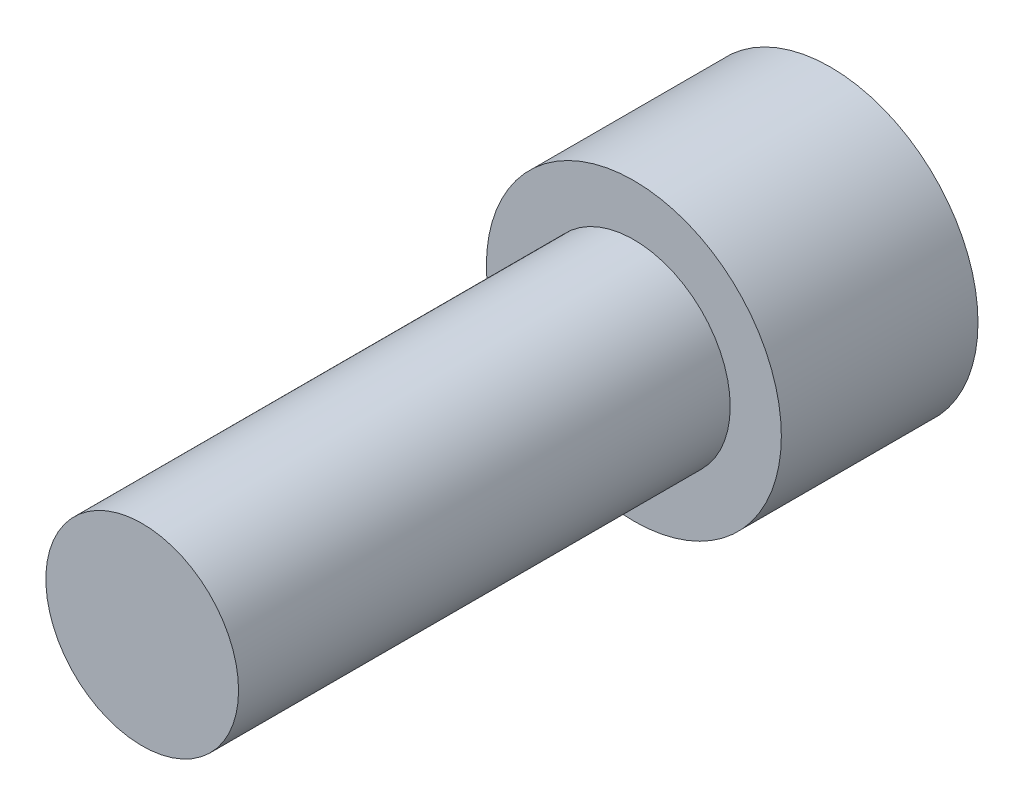
ISO-10303-21;
HEADER;
FILE_DESCRIPTION(('STEP AP214'),'2;1');
FILE_NAME('part.step','',(''),(''),'','','');
FILE_SCHEMA(('AUTOMOTIVE_DESIGN { 1 0 10303 214 1 1 1 1 }'));
ENDSEC;
DATA;
#1=APPLICATION_CONTEXT('core data for automotive mechanical design processes');
#2=APPLICATION_PROTOCOL_DEFINITION('international standard','automotive_design',2000,#1);
#3=PRODUCT_CONTEXT('',#1,'mechanical');
#4=PRODUCT('Part','Part','',(#3));
#5=PRODUCT_RELATED_PRODUCT_CATEGORY('part','',(#4));
#6=PRODUCT_DEFINITION_FORMATION('','',#4);
#7=PRODUCT_DEFINITION_CONTEXT('part definition',#1,'design');
#8=PRODUCT_DEFINITION('design','',#6,#7);
#9=PRODUCT_DEFINITION_SHAPE('','',#8);
#10=(LENGTH_UNIT() NAMED_UNIT(*) SI_UNIT(.MILLI.,.METRE.));
#11=(NAMED_UNIT(*) PLANE_ANGLE_UNIT() SI_UNIT($,.RADIAN.));
#12=(NAMED_UNIT(*) SI_UNIT($,.STERADIAN.) SOLID_ANGLE_UNIT());
#13=UNCERTAINTY_MEASURE_WITH_UNIT(LENGTH_MEASURE(1.E-05),#10,'distance_accuracy_value','');
#14=(GEOMETRIC_REPRESENTATION_CONTEXT(3) GLOBAL_UNCERTAINTY_ASSIGNED_CONTEXT((#13)) GLOBAL_UNIT_ASSIGNED_CONTEXT((#10,
#11,#12)) REPRESENTATION_CONTEXT('',''));
#15=CARTESIAN_POINT('',(0.,0.,0.));
#16=DIRECTION('',(0.,0.,1.));
#17=DIRECTION('',(1.,0.,0.));
#18=AXIS2_PLACEMENT_3D('',#15,#16,#17);
#19=CARTESIAN_POINT('',(0.,0.,17.78));
#20=DIRECTION('',(0.,0.,-1.));
#21=DIRECTION('',(-1.,0.,0.));
#22=AXIS2_PLACEMENT_3D('',#19,#20,#21);
#23=CYLINDRICAL_SURFACE('',#22,3.81);
#24=CARTESIAN_POINT('',(0.,0.,0.));
#25=DIRECTION('',(0.,0.,1.));
#26=DIRECTION('',(1.,0.,0.));
#27=AXIS2_PLACEMENT_3D('',#24,#25,#26);
#28=CIRCLE('',#27,3.81);
#29=CARTESIAN_POINT('',(3.81,0.,0.));
#30=VERTEX_POINT('',#29);
#31=EDGE_CURVE('E12',#30,#30,#28,.T.);
#32=ORIENTED_EDGE('',*,*,#31,.T.);
#33=EDGE_LOOP('',(#32));
#34=FACE_BOUND('',#33,.T.);
#35=CARTESIAN_POINT('',(0.,0.,5.08));
#36=DIRECTION('',(0.,0.,1.));
#37=DIRECTION('',(1.,0.,0.));
#38=AXIS2_PLACEMENT_3D('',#35,#36,#37);
#39=CIRCLE('',#38,3.81);
#40=CARTESIAN_POINT('',(3.81,0.,5.08));
#41=VERTEX_POINT('',#40);
#42=EDGE_CURVE('E35',#41,#41,#39,.T.);
#43=ORIENTED_EDGE('',*,*,#42,.F.);
#44=EDGE_LOOP('',(#43));
#45=FACE_BOUND('',#44,.T.);
#46=ADVANCED_FACE('F32',(#34,#45),#23,.T.);
#47=CARTESIAN_POINT('',(0.,0.,0.));
#48=DIRECTION('',(0.,0.,1.));
#49=DIRECTION('',(1.,0.,0.));
#50=AXIS2_PLACEMENT_3D('',#47,#48,#49);
#51=PLANE('',#50);
#52=DIRECTION('',(0.866025403784438,-0.500000000000001,0.));
#53=VECTOR('',#52,1.);
#54=CARTESIAN_POINT('',(0.,2.98768394834781,0.));
#55=LINE('',#54,#53);
#56=CARTESIAN_POINT('',(0.,2.98768394834781,0.));
#57=VERTEX_POINT('',#56);
#58=CARTESIAN_POINT('',(2.5874101977482,1.4938419741739,0.));
#59=VERTEX_POINT('',#58);
#60=EDGE_CURVE('E120',#57,#59,#55,.T.);
#61=ORIENTED_EDGE('',*,*,#60,.F.);
#62=DIRECTION('',(0.866025403784442,0.499999999999995,0.));
#63=VECTOR('',#62,1.);
#64=CARTESIAN_POINT('',(-2.58741019774818,1.49384197417393,0.));
#65=LINE('',#64,#63);
#66=CARTESIAN_POINT('',(-2.58741019774818,1.49384197417393,0.));
#67=VERTEX_POINT('',#66);
#68=EDGE_CURVE('E46',#67,#57,#65,.T.);
#69=ORIENTED_EDGE('',*,*,#68,.F.);
#70=DIRECTION('',(0.,1.,0.));
#71=VECTOR('',#70,1.);
#72=CARTESIAN_POINT('',(-2.58741019774821,-1.49384197417388,0.));
#73=LINE('',#72,#71);
#74=CARTESIAN_POINT('',(-2.58741019774821,-1.49384197417388,0.));
#75=VERTEX_POINT('',#74);
#76=EDGE_CURVE('E129',#75,#67,#73,.T.);
#77=ORIENTED_EDGE('',*,*,#76,.F.);
#78=DIRECTION('',(-0.866025403784434,0.500000000000007,0.));
#79=VECTOR('',#78,1.);
#80=CARTESIAN_POINT('',(0.,-2.98768394834781,0.));
#81=LINE('',#80,#79);
#82=CARTESIAN_POINT('',(0.,-2.98768394834781,0.));
#83=VERTEX_POINT('',#82);
#84=EDGE_CURVE('E127',#83,#75,#81,.T.);
#85=ORIENTED_EDGE('',*,*,#84,.F.);
#86=DIRECTION('',(-0.866025403784442,-0.499999999999995,0.));
#87=VECTOR('',#86,1.);
#88=CARTESIAN_POINT('',(2.58741019774819,-1.49384197417392,0.));
#89=LINE('',#88,#87);
#90=CARTESIAN_POINT('',(2.58741019774819,-1.49384197417392,0.));
#91=VERTEX_POINT('',#90);
#92=EDGE_CURVE('E94',#91,#83,#89,.T.);
#93=ORIENTED_EDGE('',*,*,#92,.F.);
#94=DIRECTION('',(0.,-1.,0.));
#95=VECTOR('',#94,1.);
#96=CARTESIAN_POINT('',(2.5874101977482,1.4938419741739,0.));
#97=LINE('',#96,#95);
#98=EDGE_CURVE('E123',#59,#91,#97,.T.);
#99=ORIENTED_EDGE('',*,*,#98,.F.);
#100=EDGE_LOOP('',(#61,#69,#77,#85,#93,#99));
#101=FACE_BOUND('',#100,.T.);
#102=ORIENTED_EDGE('',*,*,#31,.F.);
#103=EDGE_LOOP('',(#102));
#104=FACE_BOUND('',#103,.T.);
#105=ADVANCED_FACE('F158',(#101,#104),#51,.F.);
#106=CARTESIAN_POINT('',(0.,0.,5.08));
#107=DIRECTION('',(0.,0.,1.));
#108=DIRECTION('',(1.,0.,0.));
#109=AXIS2_PLACEMENT_3D('',#106,#107,#108);
#110=PLANE('',#109);
#111=CARTESIAN_POINT('',(0.,0.,5.08));
#112=DIRECTION('',(0.,0.,1.));
#113=DIRECTION('',(1.,0.,0.));
#114=AXIS2_PLACEMENT_3D('',#111,#112,#113);
#115=CIRCLE('',#114,2.4892);
#116=CARTESIAN_POINT('',(2.4892,0.,5.08));
#117=VERTEX_POINT('',#116);
#118=EDGE_CURVE('E139',#117,#117,#115,.T.);
#119=ORIENTED_EDGE('',*,*,#118,.F.);
#120=EDGE_LOOP('',(#119));
#121=FACE_BOUND('',#120,.T.);
#122=ORIENTED_EDGE('',*,*,#42,.T.);
#123=EDGE_LOOP('',(#122));
#124=FACE_BOUND('',#123,.T.);
#125=ADVANCED_FACE('F149',(#121,#124),#110,.T.);
#126=CARTESIAN_POINT('',(0.,0.,5.08));
#127=DIRECTION('',(0.,0.,1.));
#128=DIRECTION('',(1.,0.,0.));
#129=AXIS2_PLACEMENT_3D('',#126,#127,#128);
#130=CYLINDRICAL_SURFACE('',#129,2.4892);
#131=ORIENTED_EDGE('',*,*,#118,.T.);
#132=EDGE_LOOP('',(#131));
#133=FACE_BOUND('',#132,.T.);
#134=CARTESIAN_POINT('',(0.,0.,17.78));
#135=DIRECTION('',(0.,0.,1.));
#136=DIRECTION('',(1.,0.,0.));
#137=AXIS2_PLACEMENT_3D('',#134,#135,#136);
#138=CIRCLE('',#137,2.4892);
#139=CARTESIAN_POINT('',(2.4892,0.,17.78));
#140=VERTEX_POINT('',#139);
#141=EDGE_CURVE('E133',#140,#140,#138,.T.);
#142=ORIENTED_EDGE('',*,*,#141,.F.);
#143=EDGE_LOOP('',(#142));
#144=FACE_BOUND('',#143,.T.);
#145=ADVANCED_FACE('F147',(#133,#144),#130,.T.);
#146=CARTESIAN_POINT('',(0.,0.,17.78));
#147=DIRECTION('',(0.,0.,1.));
#148=DIRECTION('',(1.,0.,0.));
#149=AXIS2_PLACEMENT_3D('',#146,#147,#148);
#150=PLANE('',#149);
#151=ORIENTED_EDGE('',*,*,#141,.T.);
#152=EDGE_LOOP('',(#151));
#153=FACE_BOUND('',#152,.T.);
#154=ADVANCED_FACE('F145',(#153),#150,.T.);
#155=CARTESIAN_POINT('',(-2.58741019774818,1.49384197417393,3.048));
#156=DIRECTION('',(-0.499999999999995,0.866025403784442,0.));
#157=DIRECTION('',(-0.866025403784442,-0.499999999999995,0.));
#158=AXIS2_PLACEMENT_3D('',#155,#156,#157);
#159=PLANE('',#158);
#160=ORIENTED_EDGE('',*,*,#68,.T.);
#161=DIRECTION('',(0.,0.,-1.));
#162=VECTOR('',#161,1.);
#163=CARTESIAN_POINT('',(0.,2.98768394834781,3.048));
#164=LINE('',#163,#162);
#165=CARTESIAN_POINT('',(0.,2.98768394834781,3.048));
#166=VERTEX_POINT('',#165);
#167=EDGE_CURVE('E76',#166,#57,#164,.T.);
#168=ORIENTED_EDGE('',*,*,#167,.F.);
#169=DIRECTION('',(0.866025403784442,0.499999999999995,0.));
#170=VECTOR('',#169,1.);
#171=CARTESIAN_POINT('',(-2.58741019774818,1.49384197417393,3.048));
#172=LINE('',#171,#170);
#173=CARTESIAN_POINT('',(-2.58741019774818,1.49384197417393,3.048));
#174=VERTEX_POINT('',#173);
#175=EDGE_CURVE('E131',#174,#166,#172,.T.);
#176=ORIENTED_EDGE('',*,*,#175,.F.);
#177=DIRECTION('',(0.,0.,-1.));
#178=VECTOR('',#177,1.);
#179=CARTESIAN_POINT('',(-2.58741019774818,1.49384197417393,3.048));
#180=LINE('',#179,#178);
#181=EDGE_CURVE('E54',#174,#67,#180,.T.);
#182=ORIENTED_EDGE('',*,*,#181,.T.);
#183=EDGE_LOOP('',(#160,#168,#176,#182));
#184=FACE_BOUND('',#183,.T.);
#185=ADVANCED_FACE('F156',(#184),#159,.F.);
#186=CARTESIAN_POINT('',(-2.58741019774821,-1.49384197417388,3.048));
#187=DIRECTION('',(-1.,0.,0.));
#188=DIRECTION('',(0.,-1.,0.));
#189=AXIS2_PLACEMENT_3D('',#186,#187,#188);
#190=PLANE('',#189);
#191=ORIENTED_EDGE('',*,*,#76,.T.);
#192=ORIENTED_EDGE('',*,*,#181,.F.);
#193=DIRECTION('',(0.,1.,0.));
#194=VECTOR('',#193,1.);
#195=CARTESIAN_POINT('',(-2.58741019774821,-1.49384197417388,3.048));
#196=LINE('',#195,#194);
#197=CARTESIAN_POINT('',(-2.58741019774821,-1.49384197417388,3.048));
#198=VERTEX_POINT('',#197);
#199=EDGE_CURVE('E106',#198,#174,#196,.T.);
#200=ORIENTED_EDGE('',*,*,#199,.F.);
#201=DIRECTION('',(0.,0.,-1.));
#202=VECTOR('',#201,1.);
#203=CARTESIAN_POINT('',(-2.58741019774821,-1.49384197417388,3.048));
#204=LINE('',#203,#202);
#205=EDGE_CURVE('E98',#198,#75,#204,.T.);
#206=ORIENTED_EDGE('',*,*,#205,.T.);
#207=EDGE_LOOP('',(#191,#192,#200,#206));
#208=FACE_BOUND('',#207,.T.);
#209=ADVANCED_FACE('F183',(#208),#190,.F.);
#210=CARTESIAN_POINT('',(0.,-2.98768394834781,3.048));
#211=DIRECTION('',(-0.500000000000007,-0.866025403784435,0.));
#212=DIRECTION('',(0.866025403784435,-0.500000000000007,0.));
#213=AXIS2_PLACEMENT_3D('',#210,#211,#212);
#214=PLANE('',#213);
#215=ORIENTED_EDGE('',*,*,#84,.T.);
#216=ORIENTED_EDGE('',*,*,#205,.F.);
#217=DIRECTION('',(-0.866025403784434,0.500000000000007,0.));
#218=VECTOR('',#217,1.);
#219=CARTESIAN_POINT('',(0.,-2.98768394834781,3.048));
#220=LINE('',#219,#218);
#221=CARTESIAN_POINT('',(0.,-2.98768394834781,3.048));
#222=VERTEX_POINT('',#221);
#223=EDGE_CURVE('E102',#222,#198,#220,.T.);
#224=ORIENTED_EDGE('',*,*,#223,.F.);
#225=DIRECTION('',(0.,0.,-1.));
#226=VECTOR('',#225,1.);
#227=CARTESIAN_POINT('',(0.,-2.98768394834781,3.048));
#228=LINE('',#227,#226);
#229=EDGE_CURVE('E87',#222,#83,#228,.T.);
#230=ORIENTED_EDGE('',*,*,#229,.T.);
#231=EDGE_LOOP('',(#215,#216,#224,#230));
#232=FACE_BOUND('',#231,.T.);
#233=ADVANCED_FACE('F103',(#232),#214,.F.);
#234=CARTESIAN_POINT('',(2.58741019774819,-1.49384197417392,3.048));
#235=DIRECTION('',(0.499999999999995,-0.866025403784442,0.));
#236=DIRECTION('',(0.866025403784442,0.499999999999995,0.));
#237=AXIS2_PLACEMENT_3D('',#234,#235,#236);
#238=PLANE('',#237);
#239=ORIENTED_EDGE('',*,*,#92,.T.);
#240=ORIENTED_EDGE('',*,*,#229,.F.);
#241=DIRECTION('',(-0.866025403784442,-0.499999999999995,0.));
#242=VECTOR('',#241,1.);
#243=CARTESIAN_POINT('',(2.58741019774819,-1.49384197417392,3.048));
#244=LINE('',#243,#242);
#245=CARTESIAN_POINT('',(2.58741019774819,-1.49384197417392,3.048));
#246=VERTEX_POINT('',#245);
#247=EDGE_CURVE('E91',#246,#222,#244,.T.);
#248=ORIENTED_EDGE('',*,*,#247,.F.);
#249=DIRECTION('',(0.,0.,-1.));
#250=VECTOR('',#249,1.);
#251=CARTESIAN_POINT('',(2.58741019774819,-1.49384197417392,3.048));
#252=LINE('',#251,#250);
#253=EDGE_CURVE('E99',#246,#91,#252,.T.);
#254=ORIENTED_EDGE('',*,*,#253,.T.);
#255=EDGE_LOOP('',(#239,#240,#248,#254));
#256=FACE_BOUND('',#255,.T.);
#257=ADVANCED_FACE('F89',(#256),#238,.F.);
#258=CARTESIAN_POINT('',(2.5874101977482,1.4938419741739,3.048));
#259=DIRECTION('',(1.,0.,0.));
#260=DIRECTION('',(0.,1.,0.));
#261=AXIS2_PLACEMENT_3D('',#258,#259,#260);
#262=PLANE('',#261);
#263=ORIENTED_EDGE('',*,*,#98,.T.);
#264=ORIENTED_EDGE('',*,*,#253,.F.);
#265=DIRECTION('',(0.,-1.,0.));
#266=VECTOR('',#265,1.);
#267=CARTESIAN_POINT('',(2.5874101977482,1.4938419741739,3.048));
#268=LINE('',#267,#266);
#269=CARTESIAN_POINT('',(2.5874101977482,1.4938419741739,3.048));
#270=VERTEX_POINT('',#269);
#271=EDGE_CURVE('E112',#270,#246,#268,.T.);
#272=ORIENTED_EDGE('',*,*,#271,.F.);
#273=DIRECTION('',(0.,0.,-1.));
#274=VECTOR('',#273,1.);
#275=CARTESIAN_POINT('',(2.5874101977482,1.4938419741739,3.048));
#276=LINE('',#275,#274);
#277=EDGE_CURVE('E136',#270,#59,#276,.T.);
#278=ORIENTED_EDGE('',*,*,#277,.T.);
#279=EDGE_LOOP('',(#263,#264,#272,#278));
#280=FACE_BOUND('',#279,.T.);
#281=ADVANCED_FACE('F191',(#280),#262,.F.);
#282=CARTESIAN_POINT('',(0.,2.98768394834781,3.048));
#283=DIRECTION('',(0.500000000000001,0.866025403784438,0.));
#284=DIRECTION('',(-0.866025403784438,0.500000000000001,0.));
#285=AXIS2_PLACEMENT_3D('',#282,#283,#284);
#286=PLANE('',#285);
#287=ORIENTED_EDGE('',*,*,#60,.T.);
#288=ORIENTED_EDGE('',*,*,#277,.F.);
#289=DIRECTION('',(0.866025403784438,-0.500000000000001,0.));
#290=VECTOR('',#289,1.);
#291=CARTESIAN_POINT('',(0.,2.98768394834781,3.048));
#292=LINE('',#291,#290);
#293=EDGE_CURVE('E114',#166,#270,#292,.T.);
#294=ORIENTED_EDGE('',*,*,#293,.F.);
#295=ORIENTED_EDGE('',*,*,#167,.T.);
#296=EDGE_LOOP('',(#287,#288,#294,#295));
#297=FACE_BOUND('',#296,.T.);
#298=ADVANCED_FACE('F180',(#297),#286,.F.);
#299=CARTESIAN_POINT('',(0.,2.98768394834781,3.048));
#300=DIRECTION('',(0.,0.,-1.));
#301=DIRECTION('',(-1.,0.,0.));
#302=AXIS2_PLACEMENT_3D('',#299,#300,#301);
#303=PLANE('',#302);
#304=ORIENTED_EDGE('',*,*,#175,.T.);
#305=ORIENTED_EDGE('',*,*,#293,.T.);
#306=ORIENTED_EDGE('',*,*,#271,.T.);
#307=ORIENTED_EDGE('',*,*,#247,.T.);
#308=ORIENTED_EDGE('',*,*,#223,.T.);
#309=ORIENTED_EDGE('',*,*,#199,.T.);
#310=EDGE_LOOP('',(#304,#305,#306,#307,#308,#309));
#311=FACE_BOUND('',#310,.T.);
#312=ADVANCED_FACE('F109',(#311),#303,.T.);
#313=CLOSED_SHELL('',(#46,#105,#125,#145,#154,#185,#209,#233,#257,#281,#298,#312));
#314=MANIFOLD_SOLID_BREP('B2',#313);
#315=ADVANCED_BREP_SHAPE_REPRESENTATION('',(#18,#314),#14);
#316=SHAPE_DEFINITION_REPRESENTATION(#9,#315);
ENDSEC;
END-ISO-10303-21;
